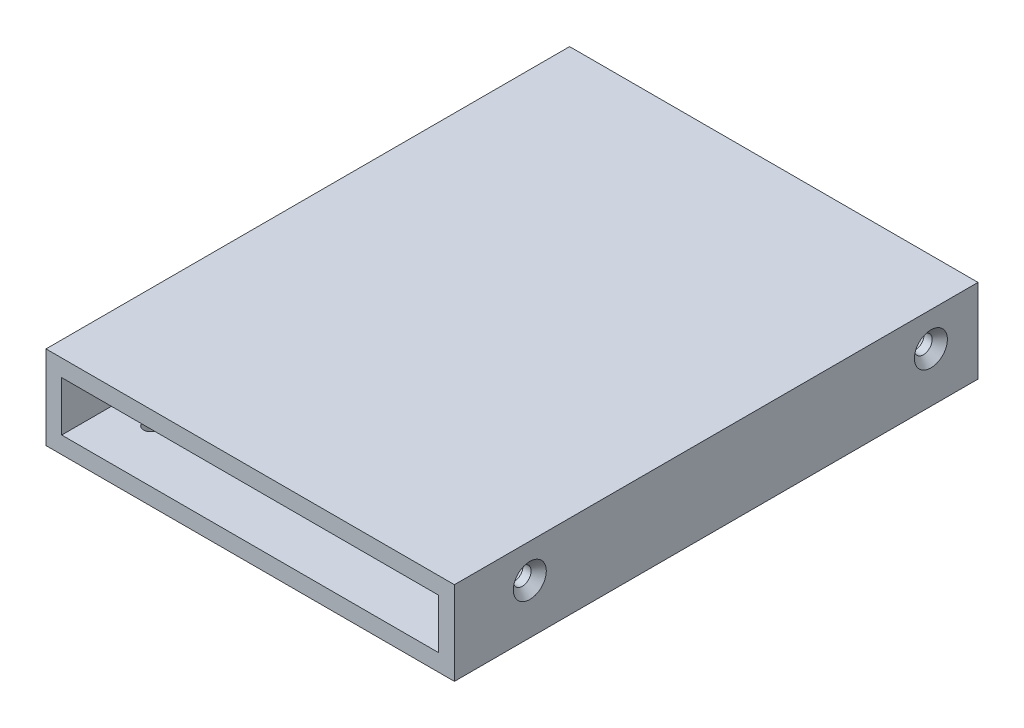
ISO-10303-21;
HEADER;
FILE_DESCRIPTION(('STEP AP214'),'2;1');
FILE_NAME('part.step','',(''),(''),'','','');
FILE_SCHEMA(('AUTOMOTIVE_DESIGN { 1 0 10303 214 1 1 1 1 }'));
ENDSEC;
DATA;
#1=APPLICATION_CONTEXT('core data for automotive mechanical design processes');
#2=APPLICATION_PROTOCOL_DEFINITION('international standard','automotive_design',2000,#1);
#3=PRODUCT_CONTEXT('',#1,'mechanical');
#4=PRODUCT('Part','Part','',(#3));
#5=PRODUCT_RELATED_PRODUCT_CATEGORY('part','',(#4));
#6=PRODUCT_DEFINITION_FORMATION('','',#4);
#7=PRODUCT_DEFINITION_CONTEXT('part definition',#1,'design');
#8=PRODUCT_DEFINITION('design','',#6,#7);
#9=PRODUCT_DEFINITION_SHAPE('','',#8);
#10=(LENGTH_UNIT() NAMED_UNIT(*) SI_UNIT(.MILLI.,.METRE.));
#11=(NAMED_UNIT(*) PLANE_ANGLE_UNIT() SI_UNIT($,.RADIAN.));
#12=(NAMED_UNIT(*) SI_UNIT($,.STERADIAN.) SOLID_ANGLE_UNIT());
#13=UNCERTAINTY_MEASURE_WITH_UNIT(LENGTH_MEASURE(1.E-05),#10,'distance_accuracy_value','');
#14=(GEOMETRIC_REPRESENTATION_CONTEXT(3) GLOBAL_UNCERTAINTY_ASSIGNED_CONTEXT((#13)) GLOBAL_UNIT_ASSIGNED_CONTEXT((#10,
#11,#12)) REPRESENTATION_CONTEXT('',''));
#15=CARTESIAN_POINT('',(0.,0.,0.));
#16=DIRECTION('',(0.,0.,1.));
#17=DIRECTION('',(1.,0.,0.));
#18=AXIS2_PLACEMENT_3D('',#15,#16,#17);
#19=CARTESIAN_POINT('',(0.,0.,100.));
#20=DIRECTION('',(0.,0.,-1.));
#21=DIRECTION('',(-1.,0.,0.));
#22=AXIS2_PLACEMENT_3D('',#19,#20,#21);
#23=PLANE('',#22);
#24=DIRECTION('',(0.,-1.,0.));
#25=VECTOR('',#24,1.);
#26=CARTESIAN_POINT('',(0.,0.,100.));
#27=LINE('',#26,#25);
#28=CARTESIAN_POINT('',(0.,16.,100.));
#29=VERTEX_POINT('',#28);
#30=CARTESIAN_POINT('',(0.,0.,100.));
#31=VERTEX_POINT('',#30);
#32=EDGE_CURVE('E135',#29,#31,#27,.T.);
#33=ORIENTED_EDGE('',*,*,#32,.T.);
#34=DIRECTION('',(1.,0.,0.));
#35=VECTOR('',#34,1.);
#36=CARTESIAN_POINT('',(0.,0.,100.));
#37=LINE('',#36,#35);
#38=CARTESIAN_POINT('',(78.,0.,100.));
#39=VERTEX_POINT('',#38);
#40=EDGE_CURVE('E138',#31,#39,#37,.T.);
#41=ORIENTED_EDGE('',*,*,#40,.T.);
#42=DIRECTION('',(0.,1.,0.));
#43=VECTOR('',#42,1.);
#44=CARTESIAN_POINT('',(78.,0.,100.));
#45=LINE('',#44,#43);
#46=CARTESIAN_POINT('',(78.,16.,100.));
#47=VERTEX_POINT('',#46);
#48=EDGE_CURVE('E141',#39,#47,#45,.T.);
#49=ORIENTED_EDGE('',*,*,#48,.T.);
#50=DIRECTION('',(-1.,0.,0.));
#51=VECTOR('',#50,1.);
#52=CARTESIAN_POINT('',(0.,16.,100.));
#53=LINE('',#52,#51);
#54=EDGE_CURVE('E143',#47,#29,#53,.T.);
#55=ORIENTED_EDGE('',*,*,#54,.T.);
#56=EDGE_LOOP('',(#33,#41,#49,#55));
#57=FACE_BOUND('',#56,.T.);
#58=DIRECTION('',(0.,-1.,0.));
#59=VECTOR('',#58,1.);
#60=CARTESIAN_POINT('',(3.,12.75,100.));
#61=LINE('',#60,#59);
#62=CARTESIAN_POINT('',(3.,12.75,100.));
#63=VERTEX_POINT('',#62);
#64=CARTESIAN_POINT('',(3.,3.25,100.));
#65=VERTEX_POINT('',#64);
#66=EDGE_CURVE('E97',#63,#65,#61,.T.);
#67=ORIENTED_EDGE('',*,*,#66,.F.);
#68=DIRECTION('',(-1.,0.,0.));
#69=VECTOR('',#68,1.);
#70=CARTESIAN_POINT('',(3.,12.75,100.));
#71=LINE('',#70,#69);
#72=CARTESIAN_POINT('',(75.,12.75,100.));
#73=VERTEX_POINT('',#72);
#74=EDGE_CURVE('E119',#73,#63,#71,.T.);
#75=ORIENTED_EDGE('',*,*,#74,.F.);
#76=DIRECTION('',(0.,1.,0.));
#77=VECTOR('',#76,1.);
#78=CARTESIAN_POINT('',(75.,12.75,100.));
#79=LINE('',#78,#77);
#80=CARTESIAN_POINT('',(75.,3.25,100.));
#81=VERTEX_POINT('',#80);
#82=EDGE_CURVE('E117',#81,#73,#79,.T.);
#83=ORIENTED_EDGE('',*,*,#82,.F.);
#84=DIRECTION('',(1.,0.,0.));
#85=VECTOR('',#84,1.);
#86=CARTESIAN_POINT('',(3.,3.25,100.));
#87=LINE('',#86,#85);
#88=EDGE_CURVE('E105',#65,#81,#87,.T.);
#89=ORIENTED_EDGE('',*,*,#88,.F.);
#90=EDGE_LOOP('',(#67,#75,#83,#89));
#91=FACE_BOUND('',#90,.T.);
#92=ADVANCED_FACE('F32',(#57,#91),#23,.F.);
#93=CARTESIAN_POINT('',(0.,0.,0.));
#94=DIRECTION('',(0.,0.,-1.));
#95=DIRECTION('',(-1.,0.,0.));
#96=AXIS2_PLACEMENT_3D('',#93,#94,#95);
#97=PLANE('',#96);
#98=DIRECTION('',(0.,-1.,0.));
#99=VECTOR('',#98,1.);
#100=CARTESIAN_POINT('',(0.,0.,0.));
#101=LINE('',#100,#99);
#102=CARTESIAN_POINT('',(0.,16.,0.));
#103=VERTEX_POINT('',#102);
#104=CARTESIAN_POINT('',(0.,0.,0.));
#105=VERTEX_POINT('',#104);
#106=EDGE_CURVE('E113',#103,#105,#101,.T.);
#107=ORIENTED_EDGE('',*,*,#106,.F.);
#108=DIRECTION('',(-1.,0.,0.));
#109=VECTOR('',#108,1.);
#110=CARTESIAN_POINT('',(0.,16.,0.));
#111=LINE('',#110,#109);
#112=CARTESIAN_POINT('',(78.,16.,0.));
#113=VERTEX_POINT('',#112);
#114=EDGE_CURVE('E139',#113,#103,#111,.T.);
#115=ORIENTED_EDGE('',*,*,#114,.F.);
#116=DIRECTION('',(0.,1.,0.));
#117=VECTOR('',#116,1.);
#118=CARTESIAN_POINT('',(78.,0.,0.));
#119=LINE('',#118,#117);
#120=CARTESIAN_POINT('',(78.,0.,0.));
#121=VERTEX_POINT('',#120);
#122=EDGE_CURVE('E150',#121,#113,#119,.T.);
#123=ORIENTED_EDGE('',*,*,#122,.F.);
#124=DIRECTION('',(1.,0.,0.));
#125=VECTOR('',#124,1.);
#126=CARTESIAN_POINT('',(0.,0.,0.));
#127=LINE('',#126,#125);
#128=EDGE_CURVE('E148',#105,#121,#127,.T.);
#129=ORIENTED_EDGE('',*,*,#128,.F.);
#130=EDGE_LOOP('',(#107,#115,#123,#129));
#131=FACE_BOUND('',#130,.T.);
#132=DIRECTION('',(-1.,0.,0.));
#133=VECTOR('',#132,1.);
#134=CARTESIAN_POINT('',(3.,12.75,0.));
#135=LINE('',#134,#133);
#136=CARTESIAN_POINT('',(75.,12.75,0.));
#137=VERTEX_POINT('',#136);
#138=CARTESIAN_POINT('',(3.,12.75,0.));
#139=VERTEX_POINT('',#138);
#140=EDGE_CURVE('E106',#137,#139,#135,.T.);
#141=ORIENTED_EDGE('',*,*,#140,.T.);
#142=DIRECTION('',(0.,-1.,0.));
#143=VECTOR('',#142,1.);
#144=CARTESIAN_POINT('',(3.,12.75,0.));
#145=LINE('',#144,#143);
#146=CARTESIAN_POINT('',(3.,3.25,0.));
#147=VERTEX_POINT('',#146);
#148=EDGE_CURVE('E55',#139,#147,#145,.T.);
#149=ORIENTED_EDGE('',*,*,#148,.T.);
#150=DIRECTION('',(1.,0.,0.));
#151=VECTOR('',#150,1.);
#152=CARTESIAN_POINT('',(3.,3.25,0.));
#153=LINE('',#152,#151);
#154=CARTESIAN_POINT('',(75.,3.25,0.));
#155=VERTEX_POINT('',#154);
#156=EDGE_CURVE('E112',#147,#155,#153,.T.);
#157=ORIENTED_EDGE('',*,*,#156,.T.);
#158=DIRECTION('',(0.,1.,0.));
#159=VECTOR('',#158,1.);
#160=CARTESIAN_POINT('',(75.,12.75,0.));
#161=LINE('',#160,#159);
#162=EDGE_CURVE('E127',#155,#137,#161,.T.);
#163=ORIENTED_EDGE('',*,*,#162,.T.);
#164=EDGE_LOOP('',(#141,#149,#157,#163));
#165=FACE_BOUND('',#164,.T.);
#166=ADVANCED_FACE('F168',(#131,#165),#97,.T.);
#167=CARTESIAN_POINT('',(0.,0.,100.));
#168=DIRECTION('',(1.,0.,0.));
#169=DIRECTION('',(0.,0.,-1.));
#170=AXIS2_PLACEMENT_3D('',#167,#168,#169);
#171=PLANE('',#170);
#172=CARTESIAN_POINT('',(0.,9.5,85.6));
#173=DIRECTION('',(-1.,0.,0.));
#174=DIRECTION('',(0.,0.,1.));
#175=AXIS2_PLACEMENT_3D('',#172,#173,#174);
#176=CIRCLE('',#175,3.15);
#177=CARTESIAN_POINT('',(0.,9.5,88.75));
#178=VERTEX_POINT('',#177);
#179=EDGE_CURVE('E230',#178,#178,#176,.T.);
#180=ORIENTED_EDGE('',*,*,#179,.F.);
#181=EDGE_LOOP('',(#180));
#182=FACE_BOUND('',#181,.T.);
#183=CARTESIAN_POINT('',(0.,9.5,8.99999999999999));
#184=DIRECTION('',(-1.,0.,0.));
#185=DIRECTION('',(0.,0.,1.));
#186=AXIS2_PLACEMENT_3D('',#183,#184,#185);
#187=CIRCLE('',#186,3.15);
#188=CARTESIAN_POINT('',(0.,9.5,12.15));
#189=VERTEX_POINT('',#188);
#190=EDGE_CURVE('E221',#189,#189,#187,.T.);
#191=ORIENTED_EDGE('',*,*,#190,.F.);
#192=EDGE_LOOP('',(#191));
#193=FACE_BOUND('',#192,.T.);
#194=ORIENTED_EDGE('',*,*,#106,.T.);
#195=DIRECTION('',(0.,0.,-1.));
#196=VECTOR('',#195,1.);
#197=CARTESIAN_POINT('',(0.,0.,100.));
#198=LINE('',#197,#196);
#199=EDGE_CURVE('E11',#31,#105,#198,.T.);
#200=ORIENTED_EDGE('',*,*,#199,.F.);
#201=ORIENTED_EDGE('',*,*,#32,.F.);
#202=DIRECTION('',(0.,0.,-1.));
#203=VECTOR('',#202,1.);
#204=CARTESIAN_POINT('',(0.,16.,100.));
#205=LINE('',#204,#203);
#206=EDGE_CURVE('E145',#29,#103,#205,.T.);
#207=ORIENTED_EDGE('',*,*,#206,.T.);
#208=EDGE_LOOP('',(#194,#200,#201,#207));
#209=FACE_BOUND('',#208,.T.);
#210=ADVANCED_FACE('F34',(#182,#193,#209),#171,.F.);
#211=CARTESIAN_POINT('',(0.,0.,100.));
#212=DIRECTION('',(0.,1.,0.));
#213=DIRECTION('',(0.,0.,1.));
#214=AXIS2_PLACEMENT_3D('',#211,#212,#213);
#215=PLANE('',#214);
#216=CARTESIAN_POINT('',(68.,0.,10.));
#217=DIRECTION('',(0.,-1.,0.));
#218=DIRECTION('',(0.,0.,-1.));
#219=AXIS2_PLACEMENT_3D('',#216,#217,#218);
#220=CIRCLE('',#219,1.35000000000001);
#221=CARTESIAN_POINT('',(68.,0.,8.65));
#222=VERTEX_POINT('',#221);
#223=EDGE_CURVE('E254',#222,#222,#220,.T.);
#224=ORIENTED_EDGE('',*,*,#223,.F.);
#225=EDGE_LOOP('',(#224));
#226=FACE_BOUND('',#225,.T.);
#227=CARTESIAN_POINT('',(10.,0.,10.));
#228=DIRECTION('',(0.,-1.,0.));
#229=DIRECTION('',(0.,0.,-1.));
#230=AXIS2_PLACEMENT_3D('',#227,#228,#229);
#231=CIRCLE('',#230,1.35);
#232=CARTESIAN_POINT('',(10.,0.,8.65));
#233=VERTEX_POINT('',#232);
#234=EDGE_CURVE('E262',#233,#233,#231,.T.);
#235=ORIENTED_EDGE('',*,*,#234,.F.);
#236=EDGE_LOOP('',(#235));
#237=FACE_BOUND('',#236,.T.);
#238=CARTESIAN_POINT('',(10.,0.,90.));
#239=DIRECTION('',(0.,-1.,0.));
#240=DIRECTION('',(0.,0.,-1.));
#241=AXIS2_PLACEMENT_3D('',#238,#239,#240);
#242=CIRCLE('',#241,1.35);
#243=CARTESIAN_POINT('',(10.,0.,88.65));
#244=VERTEX_POINT('',#243);
#245=EDGE_CURVE('E255',#244,#244,#242,.T.);
#246=ORIENTED_EDGE('',*,*,#245,.F.);
#247=EDGE_LOOP('',(#246));
#248=FACE_BOUND('',#247,.T.);
#249=CARTESIAN_POINT('',(68.,0.,90.));
#250=DIRECTION('',(0.,-1.,0.));
#251=DIRECTION('',(0.,0.,-1.));
#252=AXIS2_PLACEMENT_3D('',#249,#250,#251);
#253=CIRCLE('',#252,1.35000000000001);
#254=CARTESIAN_POINT('',(68.,0.,88.65));
#255=VERTEX_POINT('',#254);
#256=EDGE_CURVE('E248',#255,#255,#253,.T.);
#257=ORIENTED_EDGE('',*,*,#256,.F.);
#258=EDGE_LOOP('',(#257));
#259=FACE_BOUND('',#258,.T.);
#260=ORIENTED_EDGE('',*,*,#128,.T.);
#261=DIRECTION('',(0.,0.,-1.));
#262=VECTOR('',#261,1.);
#263=CARTESIAN_POINT('',(78.,0.,100.));
#264=LINE('',#263,#262);
#265=EDGE_CURVE('E40',#39,#121,#264,.T.);
#266=ORIENTED_EDGE('',*,*,#265,.F.);
#267=ORIENTED_EDGE('',*,*,#40,.F.);
#268=ORIENTED_EDGE('',*,*,#199,.T.);
#269=EDGE_LOOP('',(#260,#266,#267,#268));
#270=FACE_BOUND('',#269,.T.);
#271=ADVANCED_FACE('F178',(#226,#237,#248,#259,#270),#215,.F.);
#272=CARTESIAN_POINT('',(78.,0.,100.));
#273=DIRECTION('',(-1.,0.,0.));
#274=DIRECTION('',(0.,0.,1.));
#275=AXIS2_PLACEMENT_3D('',#272,#273,#274);
#276=PLANE('',#275);
#277=CARTESIAN_POINT('',(78.,9.5,8.99999999999999));
#278=DIRECTION('',(1.,0.,0.));
#279=DIRECTION('',(0.,0.,-1.));
#280=AXIS2_PLACEMENT_3D('',#277,#278,#279);
#281=CIRCLE('',#280,3.15);
#282=CARTESIAN_POINT('',(78.,9.5,5.84999999999999));
#283=VERTEX_POINT('',#282);
#284=EDGE_CURVE('E245',#283,#283,#281,.T.);
#285=ORIENTED_EDGE('',*,*,#284,.F.);
#286=EDGE_LOOP('',(#285));
#287=FACE_BOUND('',#286,.T.);
#288=CARTESIAN_POINT('',(78.,9.5,85.6));
#289=DIRECTION('',(1.,0.,0.));
#290=DIRECTION('',(0.,0.,-1.));
#291=AXIS2_PLACEMENT_3D('',#288,#289,#290);
#292=CIRCLE('',#291,3.15);
#293=CARTESIAN_POINT('',(78.,9.5,82.45));
#294=VERTEX_POINT('',#293);
#295=EDGE_CURVE('E239',#294,#294,#292,.T.);
#296=ORIENTED_EDGE('',*,*,#295,.F.);
#297=EDGE_LOOP('',(#296));
#298=FACE_BOUND('',#297,.T.);
#299=ORIENTED_EDGE('',*,*,#122,.T.);
#300=DIRECTION('',(0.,0.,-1.));
#301=VECTOR('',#300,1.);
#302=CARTESIAN_POINT('',(78.,16.,100.));
#303=LINE('',#302,#301);
#304=EDGE_CURVE('E155',#47,#113,#303,.T.);
#305=ORIENTED_EDGE('',*,*,#304,.F.);
#306=ORIENTED_EDGE('',*,*,#48,.F.);
#307=ORIENTED_EDGE('',*,*,#265,.T.);
#308=EDGE_LOOP('',(#299,#305,#306,#307));
#309=FACE_BOUND('',#308,.T.);
#310=ADVANCED_FACE('F162',(#287,#298,#309),#276,.F.);
#311=CARTESIAN_POINT('',(0.,16.,100.));
#312=DIRECTION('',(0.,-1.,0.));
#313=DIRECTION('',(0.,0.,-1.));
#314=AXIS2_PLACEMENT_3D('',#311,#312,#313);
#315=PLANE('',#314);
#316=ORIENTED_EDGE('',*,*,#114,.T.);
#317=ORIENTED_EDGE('',*,*,#206,.F.);
#318=ORIENTED_EDGE('',*,*,#54,.F.);
#319=ORIENTED_EDGE('',*,*,#304,.T.);
#320=EDGE_LOOP('',(#316,#317,#318,#319));
#321=FACE_BOUND('',#320,.T.);
#322=ADVANCED_FACE('F172',(#321),#315,.F.);
#323=CARTESIAN_POINT('',(3.,12.75,100.));
#324=DIRECTION('',(1.,0.,0.));
#325=DIRECTION('',(0.,0.,-1.));
#326=AXIS2_PLACEMENT_3D('',#323,#324,#325);
#327=PLANE('',#326);
#328=CARTESIAN_POINT('',(3.,9.5,85.6));
#329=DIRECTION('',(1.,0.,0.));
#330=DIRECTION('',(0.,0.,-1.));
#331=AXIS2_PLACEMENT_3D('',#328,#329,#330);
#332=CIRCLE('',#331,1.69999999999999);
#333=CARTESIAN_POINT('',(3.,9.5,83.9));
#334=VERTEX_POINT('',#333);
#335=EDGE_CURVE('E212',#334,#334,#332,.T.);
#336=ORIENTED_EDGE('',*,*,#335,.F.);
#337=EDGE_LOOP('',(#336));
#338=FACE_BOUND('',#337,.T.);
#339=CARTESIAN_POINT('',(3.,9.5,8.99999999999999));
#340=DIRECTION('',(1.,0.,0.));
#341=DIRECTION('',(0.,0.,-1.));
#342=AXIS2_PLACEMENT_3D('',#339,#340,#341);
#343=CIRCLE('',#342,1.69999999999999);
#344=CARTESIAN_POINT('',(3.,9.5,7.3));
#345=VERTEX_POINT('',#344);
#346=EDGE_CURVE('E215',#345,#345,#343,.T.);
#347=ORIENTED_EDGE('',*,*,#346,.F.);
#348=EDGE_LOOP('',(#347));
#349=FACE_BOUND('',#348,.T.);
#350=ORIENTED_EDGE('',*,*,#148,.F.);
#351=DIRECTION('',(0.,0.,-1.));
#352=VECTOR('',#351,1.);
#353=CARTESIAN_POINT('',(3.,12.75,100.));
#354=LINE('',#353,#352);
#355=EDGE_CURVE('E101',#63,#139,#354,.T.);
#356=ORIENTED_EDGE('',*,*,#355,.F.);
#357=ORIENTED_EDGE('',*,*,#66,.T.);
#358=DIRECTION('',(0.,0.,-1.));
#359=VECTOR('',#358,1.);
#360=CARTESIAN_POINT('',(3.,3.25,100.));
#361=LINE('',#360,#359);
#362=EDGE_CURVE('E100',#65,#147,#361,.T.);
#363=ORIENTED_EDGE('',*,*,#362,.T.);
#364=EDGE_LOOP('',(#350,#356,#357,#363));
#365=FACE_BOUND('',#364,.T.);
#366=ADVANCED_FACE('F99',(#338,#349,#365),#327,.T.);
#367=CARTESIAN_POINT('',(3.,3.25,100.));
#368=DIRECTION('',(0.,1.,0.));
#369=DIRECTION('',(0.,0.,1.));
#370=AXIS2_PLACEMENT_3D('',#367,#368,#369);
#371=PLANE('',#370);
#372=CARTESIAN_POINT('',(68.,3.25,10.));
#373=DIRECTION('',(0.,1.,0.));
#374=DIRECTION('',(0.,0.,1.));
#375=AXIS2_PLACEMENT_3D('',#372,#373,#374);
#376=CIRCLE('',#375,1.35000000000001);
#377=CARTESIAN_POINT('',(68.,3.25,11.35));
#378=VERTEX_POINT('',#377);
#379=EDGE_CURVE('E265',#378,#378,#376,.F.);
#380=ORIENTED_EDGE('',*,*,#379,.T.);
#381=EDGE_LOOP('',(#380));
#382=FACE_BOUND('',#381,.T.);
#383=CARTESIAN_POINT('',(10.,3.25,10.));
#384=DIRECTION('',(0.,1.,0.));
#385=DIRECTION('',(0.,0.,1.));
#386=AXIS2_PLACEMENT_3D('',#383,#384,#385);
#387=CIRCLE('',#386,1.35);
#388=CARTESIAN_POINT('',(10.,3.25,11.35));
#389=VERTEX_POINT('',#388);
#390=EDGE_CURVE('E258',#389,#389,#387,.F.);
#391=ORIENTED_EDGE('',*,*,#390,.T.);
#392=EDGE_LOOP('',(#391));
#393=FACE_BOUND('',#392,.T.);
#394=CARTESIAN_POINT('',(10.,3.25,90.));
#395=DIRECTION('',(0.,1.,0.));
#396=DIRECTION('',(0.,0.,1.));
#397=AXIS2_PLACEMENT_3D('',#394,#395,#396);
#398=CIRCLE('',#397,1.35);
#399=CARTESIAN_POINT('',(10.,3.25,91.35));
#400=VERTEX_POINT('',#399);
#401=EDGE_CURVE('E259',#400,#400,#398,.F.);
#402=ORIENTED_EDGE('',*,*,#401,.T.);
#403=EDGE_LOOP('',(#402));
#404=FACE_BOUND('',#403,.T.);
#405=CARTESIAN_POINT('',(68.,3.25,90.));
#406=DIRECTION('',(0.,1.,0.));
#407=DIRECTION('',(0.,0.,1.));
#408=AXIS2_PLACEMENT_3D('',#405,#406,#407);
#409=CIRCLE('',#408,1.35000000000001);
#410=CARTESIAN_POINT('',(68.,3.25,91.35));
#411=VERTEX_POINT('',#410);
#412=EDGE_CURVE('E251',#411,#411,#409,.F.);
#413=ORIENTED_EDGE('',*,*,#412,.T.);
#414=EDGE_LOOP('',(#413));
#415=FACE_BOUND('',#414,.T.);
#416=ORIENTED_EDGE('',*,*,#156,.F.);
#417=ORIENTED_EDGE('',*,*,#362,.F.);
#418=ORIENTED_EDGE('',*,*,#88,.T.);
#419=DIRECTION('',(0.,0.,-1.));
#420=VECTOR('',#419,1.);
#421=CARTESIAN_POINT('',(75.,3.25,100.));
#422=LINE('',#421,#420);
#423=EDGE_CURVE('E114',#81,#155,#422,.T.);
#424=ORIENTED_EDGE('',*,*,#423,.T.);
#425=EDGE_LOOP('',(#416,#417,#418,#424));
#426=FACE_BOUND('',#425,.T.);
#427=ADVANCED_FACE('F109',(#382,#393,#404,#415,#426),#371,.T.);
#428=CARTESIAN_POINT('',(75.,12.75,100.));
#429=DIRECTION('',(-1.,0.,0.));
#430=DIRECTION('',(0.,0.,1.));
#431=AXIS2_PLACEMENT_3D('',#428,#429,#430);
#432=PLANE('',#431);
#433=CARTESIAN_POINT('',(75.,9.5,85.6));
#434=DIRECTION('',(-1.,0.,0.));
#435=DIRECTION('',(0.,0.,1.));
#436=AXIS2_PLACEMENT_3D('',#433,#434,#435);
#437=CIRCLE('',#436,1.69999999999999);
#438=CARTESIAN_POINT('',(75.,9.5,87.3));
#439=VERTEX_POINT('',#438);
#440=EDGE_CURVE('E233',#439,#439,#437,.T.);
#441=ORIENTED_EDGE('',*,*,#440,.F.);
#442=EDGE_LOOP('',(#441));
#443=FACE_BOUND('',#442,.T.);
#444=CARTESIAN_POINT('',(75.,9.5,8.99999999999999));
#445=DIRECTION('',(-1.,0.,0.));
#446=DIRECTION('',(0.,0.,1.));
#447=AXIS2_PLACEMENT_3D('',#444,#445,#446);
#448=CIRCLE('',#447,1.69999999999999);
#449=CARTESIAN_POINT('',(75.,9.5,10.7));
#450=VERTEX_POINT('',#449);
#451=EDGE_CURVE('E125',#450,#450,#448,.T.);
#452=ORIENTED_EDGE('',*,*,#451,.F.);
#453=EDGE_LOOP('',(#452));
#454=FACE_BOUND('',#453,.T.);
#455=ORIENTED_EDGE('',*,*,#162,.F.);
#456=ORIENTED_EDGE('',*,*,#423,.F.);
#457=ORIENTED_EDGE('',*,*,#82,.T.);
#458=DIRECTION('',(0.,0.,-1.));
#459=VECTOR('',#458,1.);
#460=CARTESIAN_POINT('',(75.,12.75,100.));
#461=LINE('',#460,#459);
#462=EDGE_CURVE('E47',#73,#137,#461,.T.);
#463=ORIENTED_EDGE('',*,*,#462,.T.);
#464=EDGE_LOOP('',(#455,#456,#457,#463));
#465=FACE_BOUND('',#464,.T.);
#466=ADVANCED_FACE('F207',(#443,#454,#465),#432,.T.);
#467=CARTESIAN_POINT('',(3.,12.75,100.));
#468=DIRECTION('',(0.,-1.,0.));
#469=DIRECTION('',(0.,0.,-1.));
#470=AXIS2_PLACEMENT_3D('',#467,#468,#469);
#471=PLANE('',#470);
#472=ORIENTED_EDGE('',*,*,#140,.F.);
#473=ORIENTED_EDGE('',*,*,#462,.F.);
#474=ORIENTED_EDGE('',*,*,#74,.T.);
#475=ORIENTED_EDGE('',*,*,#355,.T.);
#476=EDGE_LOOP('',(#472,#473,#474,#475));
#477=FACE_BOUND('',#476,.T.);
#478=ADVANCED_FACE('F321',(#477),#471,.T.);
#479=CARTESIAN_POINT('',(0.,9.5,8.99999999999999));
#480=DIRECTION('',(-1.,0.,0.));
#481=DIRECTION('',(0.,0.,1.));
#482=AXIS2_PLACEMENT_3D('',#479,#480,#481);
#483=CYLINDRICAL_SURFACE('',#482,1.69999999999999);
#484=CARTESIAN_POINT('',(76.55,9.5,8.99999999999999));
#485=DIRECTION('',(1.,0.,0.));
#486=DIRECTION('',(0.,0.,-1.));
#487=AXIS2_PLACEMENT_3D('',#484,#485,#486);
#488=CIRCLE('',#487,1.69999999999999);
#489=CARTESIAN_POINT('',(76.55,9.5,7.30000000000001));
#490=VERTEX_POINT('',#489);
#491=EDGE_CURVE('E242',#490,#490,#488,.T.);
#492=ORIENTED_EDGE('',*,*,#491,.T.);
#493=EDGE_LOOP('',(#492));
#494=FACE_BOUND('',#493,.T.);
#495=ORIENTED_EDGE('',*,*,#451,.T.);
#496=EDGE_LOOP('',(#495));
#497=FACE_BOUND('',#496,.T.);
#498=ADVANCED_FACE('F320',(#494,#497),#483,.F.);
#499=ORIENTED_EDGE('',*,*,#346,.T.);
#500=EDGE_LOOP('',(#499));
#501=FACE_BOUND('',#500,.T.);
#502=CARTESIAN_POINT('',(1.45,9.5,8.99999999999999));
#503=DIRECTION('',(-1.,0.,0.));
#504=DIRECTION('',(0.,0.,1.));
#505=AXIS2_PLACEMENT_3D('',#502,#503,#504);
#506=CIRCLE('',#505,1.7);
#507=CARTESIAN_POINT('',(1.45,9.5,10.7));
#508=VERTEX_POINT('',#507);
#509=EDGE_CURVE('E217',#508,#508,#506,.T.);
#510=ORIENTED_EDGE('',*,*,#509,.T.);
#511=EDGE_LOOP('',(#510));
#512=FACE_BOUND('',#511,.T.);
#513=ADVANCED_FACE('F316',(#501,#512),#483,.F.);
#514=CARTESIAN_POINT('',(0.,9.5,8.99999999999999));
#515=DIRECTION('',(-1.,0.,0.));
#516=DIRECTION('',(0.,0.,1.));
#517=AXIS2_PLACEMENT_3D('',#514,#515,#516);
#518=CONICAL_SURFACE('',#517,3.15,0.785398163397448);
#519=ORIENTED_EDGE('',*,*,#509,.F.);
#520=EDGE_LOOP('',(#519));
#521=FACE_BOUND('',#520,.T.);
#522=ORIENTED_EDGE('',*,*,#190,.T.);
#523=EDGE_LOOP('',(#522));
#524=FACE_BOUND('',#523,.T.);
#525=ADVANCED_FACE('F312',(#521,#524),#518,.F.);
#526=CARTESIAN_POINT('',(0.,9.5,85.6));
#527=DIRECTION('',(-1.,0.,0.));
#528=DIRECTION('',(0.,0.,1.));
#529=AXIS2_PLACEMENT_3D('',#526,#527,#528);
#530=CYLINDRICAL_SURFACE('',#529,1.69999999999999);
#531=ORIENTED_EDGE('',*,*,#335,.T.);
#532=EDGE_LOOP('',(#531));
#533=FACE_BOUND('',#532,.T.);
#534=CARTESIAN_POINT('',(1.45,9.5,85.6));
#535=DIRECTION('',(-1.,0.,0.));
#536=DIRECTION('',(0.,0.,1.));
#537=AXIS2_PLACEMENT_3D('',#534,#535,#536);
#538=CIRCLE('',#537,1.7);
#539=CARTESIAN_POINT('',(1.45,9.5,87.3));
#540=VERTEX_POINT('',#539);
#541=EDGE_CURVE('E226',#540,#540,#538,.T.);
#542=ORIENTED_EDGE('',*,*,#541,.T.);
#543=EDGE_LOOP('',(#542));
#544=FACE_BOUND('',#543,.T.);
#545=ADVANCED_FACE('F308',(#533,#544),#530,.F.);
#546=CARTESIAN_POINT('',(0.,9.5,85.6));
#547=DIRECTION('',(-1.,0.,0.));
#548=DIRECTION('',(0.,0.,1.));
#549=AXIS2_PLACEMENT_3D('',#546,#547,#548);
#550=CONICAL_SURFACE('',#549,3.15,0.785398163397448);
#551=ORIENTED_EDGE('',*,*,#541,.F.);
#552=EDGE_LOOP('',(#551));
#553=FACE_BOUND('',#552,.T.);
#554=ORIENTED_EDGE('',*,*,#179,.T.);
#555=EDGE_LOOP('',(#554));
#556=FACE_BOUND('',#555,.T.);
#557=ADVANCED_FACE('F304',(#553,#556),#550,.F.);
#558=CARTESIAN_POINT('',(0.,9.5,85.6));
#559=DIRECTION('',(-1.,0.,0.));
#560=DIRECTION('',(0.,0.,1.));
#561=AXIS2_PLACEMENT_3D('',#558,#559,#560);
#562=CYLINDRICAL_SURFACE('',#561,1.69999999999999);
#563=CARTESIAN_POINT('',(76.55,9.5,85.6));
#564=DIRECTION('',(1.,0.,0.));
#565=DIRECTION('',(0.,0.,-1.));
#566=AXIS2_PLACEMENT_3D('',#563,#564,#565);
#567=CIRCLE('',#566,1.69999999999999);
#568=CARTESIAN_POINT('',(76.55,9.5,83.9));
#569=VERTEX_POINT('',#568);
#570=EDGE_CURVE('E236',#569,#569,#567,.T.);
#571=ORIENTED_EDGE('',*,*,#570,.T.);
#572=EDGE_LOOP('',(#571));
#573=FACE_BOUND('',#572,.T.);
#574=ORIENTED_EDGE('',*,*,#440,.T.);
#575=EDGE_LOOP('',(#574));
#576=FACE_BOUND('',#575,.T.);
#577=ADVANCED_FACE('F300',(#573,#576),#562,.F.);
#578=CARTESIAN_POINT('',(78.,9.5,85.6));
#579=DIRECTION('',(1.,0.,0.));
#580=DIRECTION('',(0.,0.,-1.));
#581=AXIS2_PLACEMENT_3D('',#578,#579,#580);
#582=CONICAL_SURFACE('',#581,3.15,0.78539816339745);
#583=ORIENTED_EDGE('',*,*,#570,.F.);
#584=EDGE_LOOP('',(#583));
#585=FACE_BOUND('',#584,.T.);
#586=ORIENTED_EDGE('',*,*,#295,.T.);
#587=EDGE_LOOP('',(#586));
#588=FACE_BOUND('',#587,.T.);
#589=ADVANCED_FACE('F296',(#585,#588),#582,.F.);
#590=CARTESIAN_POINT('',(78.,9.5,8.99999999999999));
#591=DIRECTION('',(1.,0.,0.));
#592=DIRECTION('',(0.,0.,-1.));
#593=AXIS2_PLACEMENT_3D('',#590,#591,#592);
#594=CONICAL_SURFACE('',#593,3.15,0.78539816339745);
#595=ORIENTED_EDGE('',*,*,#491,.F.);
#596=EDGE_LOOP('',(#595));
#597=FACE_BOUND('',#596,.T.);
#598=ORIENTED_EDGE('',*,*,#284,.T.);
#599=EDGE_LOOP('',(#598));
#600=FACE_BOUND('',#599,.T.);
#601=ADVANCED_FACE('F292',(#597,#600),#594,.F.);
#602=CARTESIAN_POINT('',(68.,16.001,90.));
#603=DIRECTION('',(0.,-1.,0.));
#604=DIRECTION('',(0.,0.,-1.));
#605=AXIS2_PLACEMENT_3D('',#602,#603,#604);
#606=CYLINDRICAL_SURFACE('',#605,1.35000000000001);
#607=ORIENTED_EDGE('',*,*,#412,.F.);
#608=EDGE_LOOP('',(#607));
#609=FACE_BOUND('',#608,.T.);
#610=ORIENTED_EDGE('',*,*,#256,.T.);
#611=EDGE_LOOP('',(#610));
#612=FACE_BOUND('',#611,.T.);
#613=ADVANCED_FACE('F288',(#609,#612),#606,.F.);
#614=CARTESIAN_POINT('',(10.,16.001,90.));
#615=DIRECTION('',(0.,-1.,0.));
#616=DIRECTION('',(0.,0.,-1.));
#617=AXIS2_PLACEMENT_3D('',#614,#615,#616);
#618=CYLINDRICAL_SURFACE('',#617,1.35);
#619=ORIENTED_EDGE('',*,*,#401,.F.);
#620=EDGE_LOOP('',(#619));
#621=FACE_BOUND('',#620,.T.);
#622=ORIENTED_EDGE('',*,*,#245,.T.);
#623=EDGE_LOOP('',(#622));
#624=FACE_BOUND('',#623,.T.);
#625=ADVANCED_FACE('F282',(#621,#624),#618,.F.);
#626=CARTESIAN_POINT('',(10.,16.001,10.));
#627=DIRECTION('',(0.,-1.,0.));
#628=DIRECTION('',(0.,0.,-1.));
#629=AXIS2_PLACEMENT_3D('',#626,#627,#628);
#630=CYLINDRICAL_SURFACE('',#629,1.35);
#631=ORIENTED_EDGE('',*,*,#390,.F.);
#632=EDGE_LOOP('',(#631));
#633=FACE_BOUND('',#632,.T.);
#634=ORIENTED_EDGE('',*,*,#234,.T.);
#635=EDGE_LOOP('',(#634));
#636=FACE_BOUND('',#635,.T.);
#637=ADVANCED_FACE('F277',(#633,#636),#630,.F.);
#638=CARTESIAN_POINT('',(68.,16.001,10.));
#639=DIRECTION('',(0.,-1.,0.));
#640=DIRECTION('',(0.,0.,-1.));
#641=AXIS2_PLACEMENT_3D('',#638,#639,#640);
#642=CYLINDRICAL_SURFACE('',#641,1.35000000000001);
#643=ORIENTED_EDGE('',*,*,#379,.F.);
#644=EDGE_LOOP('',(#643));
#645=FACE_BOUND('',#644,.T.);
#646=ORIENTED_EDGE('',*,*,#223,.T.);
#647=EDGE_LOOP('',(#646));
#648=FACE_BOUND('',#647,.T.);
#649=ADVANCED_FACE('F274',(#645,#648),#642,.F.);
#650=CLOSED_SHELL('',(#92,#166,#210,#271,#310,#322,#366,#427,#466,#478,#498,#513,#525,#545,#557,
#577,#589,#601,#613,#625,#637,#649));
#651=MANIFOLD_SOLID_BREP('B2',#650);
#652=ADVANCED_BREP_SHAPE_REPRESENTATION('',(#18,#651),#14);
#653=SHAPE_DEFINITION_REPRESENTATION(#9,#652);
ENDSEC;
END-ISO-10303-21;
